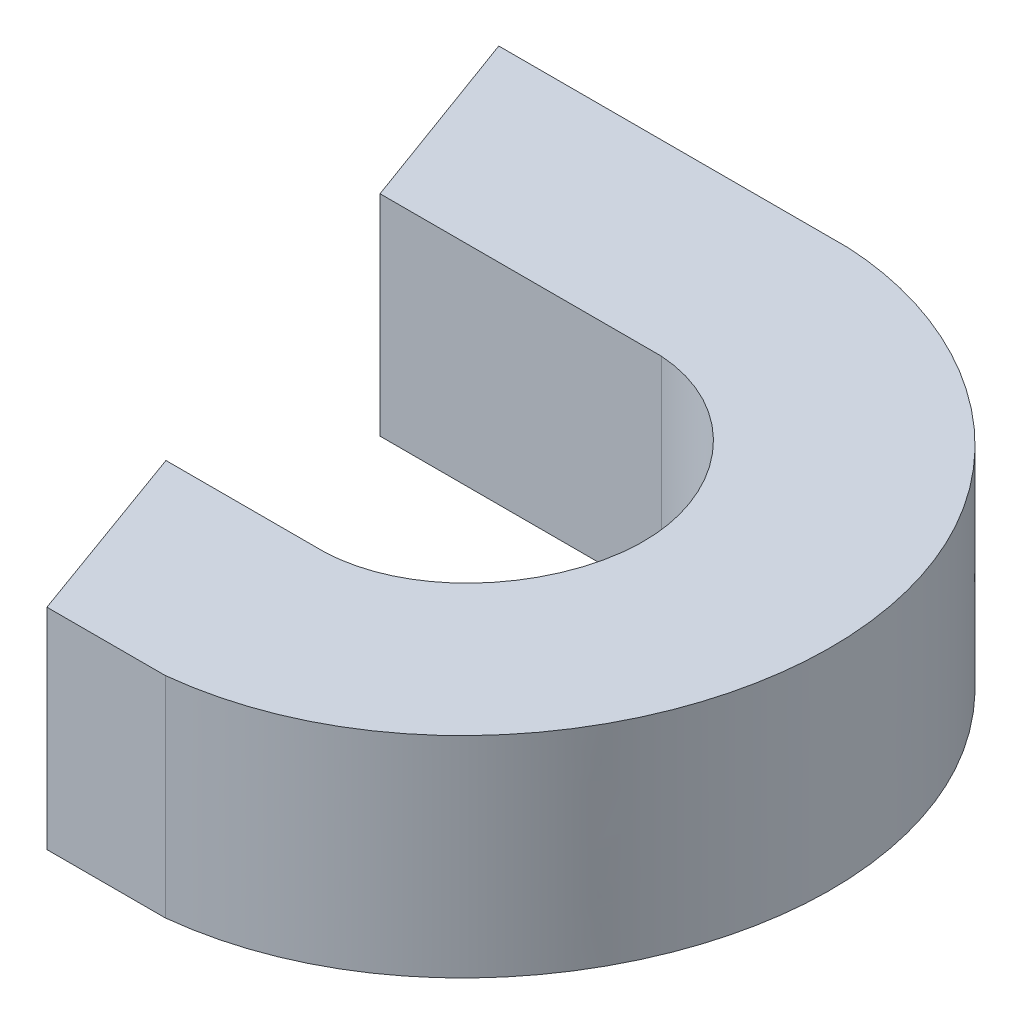
ISO-10303-21;
HEADER;
FILE_DESCRIPTION(('STEP AP214'),'2;1');
FILE_NAME('part.step','',(''),(''),'','','');
FILE_SCHEMA(('AUTOMOTIVE_DESIGN { 1 0 10303 214 1 1 1 1 }'));
ENDSEC;
DATA;
#1=APPLICATION_CONTEXT('core data for automotive mechanical design processes');
#2=APPLICATION_PROTOCOL_DEFINITION('international standard','automotive_design',2000,#1);
#3=PRODUCT_CONTEXT('',#1,'mechanical');
#4=PRODUCT('Part','Part','',(#3));
#5=PRODUCT_RELATED_PRODUCT_CATEGORY('part','',(#4));
#6=PRODUCT_DEFINITION_FORMATION('','',#4);
#7=PRODUCT_DEFINITION_CONTEXT('part definition',#1,'design');
#8=PRODUCT_DEFINITION('design','',#6,#7);
#9=PRODUCT_DEFINITION_SHAPE('','',#8);
#10=(LENGTH_UNIT() NAMED_UNIT(*) SI_UNIT(.MILLI.,.METRE.));
#11=(NAMED_UNIT(*) PLANE_ANGLE_UNIT() SI_UNIT($,.RADIAN.));
#12=(NAMED_UNIT(*) SI_UNIT($,.STERADIAN.) SOLID_ANGLE_UNIT());
#13=UNCERTAINTY_MEASURE_WITH_UNIT(LENGTH_MEASURE(1.E-05),#10,'distance_accuracy_value','');
#14=(GEOMETRIC_REPRESENTATION_CONTEXT(3) GLOBAL_UNCERTAINTY_ASSIGNED_CONTEXT((#13)) GLOBAL_UNIT_ASSIGNED_CONTEXT((#10,
#11,#12)) REPRESENTATION_CONTEXT('',''));
#15=CARTESIAN_POINT('',(0.,0.,0.));
#16=DIRECTION('',(0.,0.,1.));
#17=DIRECTION('',(1.,0.,0.));
#18=AXIS2_PLACEMENT_3D('',#15,#16,#17);
#19=CARTESIAN_POINT('',(162.372425992695,10.,-181.612223799451));
#20=DIRECTION('',(0.940293304521291,0.,-0.340365247157271));
#21=DIRECTION('',(-0.340365247157271,0.,-0.940293304521291));
#22=AXIS2_PLACEMENT_3D('',#19,#20,#21);
#23=PLANE('',#22);
#24=DIRECTION('',(0.340365247157271,0.,0.940293304521291));
#25=VECTOR('',#24,1.);
#26=CARTESIAN_POINT('',(162.372425992695,0.,-181.612223799451));
#27=LINE('',#26,#25);
#28=CARTESIAN_POINT('',(162.372425992695,0.,-181.612223799451));
#29=VERTEX_POINT('',#28);
#30=CARTESIAN_POINT('',(165.588889592896,0.,-172.726418880279));
#31=VERTEX_POINT('',#30);
#32=EDGE_CURVE('E189',#29,#31,#27,.T.);
#33=ORIENTED_EDGE('',*,*,#32,.T.);
#34=DIRECTION('',(0.,-1.,0.));
#35=VECTOR('',#34,1.);
#36=CARTESIAN_POINT('',(165.588889592896,10.,-172.726418880279));
#37=LINE('',#36,#35);
#38=CARTESIAN_POINT('',(165.588889592896,10.,-172.726418880279));
#39=VERTEX_POINT('',#38);
#40=EDGE_CURVE('E11',#39,#31,#37,.T.);
#41=ORIENTED_EDGE('',*,*,#40,.F.);
#42=DIRECTION('',(0.340365247157271,0.,0.940293304521291));
#43=VECTOR('',#42,1.);
#44=CARTESIAN_POINT('',(162.372425992695,10.,-181.612223799451));
#45=LINE('',#44,#43);
#46=CARTESIAN_POINT('',(162.372425992695,10.,-181.612223799451));
#47=VERTEX_POINT('',#46);
#48=EDGE_CURVE('E206',#47,#39,#45,.T.);
#49=ORIENTED_EDGE('',*,*,#48,.F.);
#50=DIRECTION('',(0.,-1.,0.));
#51=VECTOR('',#50,1.);
#52=CARTESIAN_POINT('',(162.372425992695,10.,-181.612223799451));
#53=LINE('',#52,#51);
#54=EDGE_CURVE('E122',#47,#29,#53,.T.);
#55=ORIENTED_EDGE('',*,*,#54,.T.);
#56=EDGE_LOOP('',(#33,#41,#49,#55));
#57=FACE_BOUND('',#56,.T.);
#58=ADVANCED_FACE('F30',(#57),#23,.F.);
#59=CARTESIAN_POINT('',(165.588889592896,10.,-172.726418880279));
#60=DIRECTION('',(0.,0.,-1.));
#61=DIRECTION('',(-1.,0.,0.));
#62=AXIS2_PLACEMENT_3D('',#59,#60,#61);
#63=PLANE('',#62);
#64=DIRECTION('',(1.,0.,0.));
#65=VECTOR('',#64,1.);
#66=CARTESIAN_POINT('',(165.588889592896,0.,-172.726418880279));
#67=LINE('',#66,#65);
#68=CARTESIAN_POINT('',(171.228007085612,0.,-172.726418880279));
#69=VERTEX_POINT('',#68);
#70=EDGE_CURVE('E186',#31,#69,#67,.T.);
#71=ORIENTED_EDGE('',*,*,#70,.T.);
#72=DIRECTION('',(0.,-1.,0.));
#73=VECTOR('',#72,1.);
#74=CARTESIAN_POINT('',(171.228007085612,10.,-172.726418880279));
#75=LINE('',#74,#73);
#76=CARTESIAN_POINT('',(171.228007085612,10.,-172.726418880279));
#77=VERTEX_POINT('',#76);
#78=EDGE_CURVE('E38',#77,#69,#75,.T.);
#79=ORIENTED_EDGE('',*,*,#78,.F.);
#80=DIRECTION('',(1.,0.,0.));
#81=VECTOR('',#80,1.);
#82=CARTESIAN_POINT('',(165.588889592896,10.,-172.726418880279));
#83=LINE('',#82,#81);
#84=EDGE_CURVE('E89',#39,#77,#83,.T.);
#85=ORIENTED_EDGE('',*,*,#84,.F.);
#86=ORIENTED_EDGE('',*,*,#40,.T.);
#87=EDGE_LOOP('',(#71,#79,#85,#86));
#88=FACE_BOUND('',#87,.T.);
#89=ADVANCED_FACE('F151',(#88),#63,.F.);
#90=CARTESIAN_POINT('',(171.228007085612,10.,-172.726418880279));
#91=CARTESIAN_POINT('',(180.377690760818,10.,-173.72553296733));
#92=CARTESIAN_POINT('',(187.93256805129,10.,-184.626735463749));
#93=CARTESIAN_POINT('',(183.685185867495,10.,-201.055507750901));
#94=CARTESIAN_POINT('',(175.689909714584,10.,-206.325221105294));
#95=CARTESIAN_POINT('',(169.867934904106,10.,-206.636519035794));
#96=B_SPLINE_CURVE_WITH_KNOTS('',3,(#90,#91,#92,#93,#94,#95),.UNSPECIFIED.,.F.,.F.,(4,1,1,4),
(0.,0.495187000090538,0.646189602277731,1.),.UNSPECIFIED.);
#97=DIRECTION('',(0.,-1.,0.));
#98=VECTOR('',#97,1.);
#99=SURFACE_OF_LINEAR_EXTRUSION('',#96,#98);
#100=CARTESIAN_POINT('',(171.228007085612,0.,-172.726418880279));
#101=CARTESIAN_POINT('',(180.377690760818,0.,-173.72553296733));
#102=CARTESIAN_POINT('',(187.93256805129,0.,-184.626735463749));
#103=CARTESIAN_POINT('',(183.685185867495,0.,-201.055507750901));
#104=CARTESIAN_POINT('',(175.689909714584,0.,-206.325221105294));
#105=CARTESIAN_POINT('',(169.867934904106,0.,-206.636519035794));
#106=B_SPLINE_CURVE_WITH_KNOTS('',3,(#100,#101,#102,#103,#104,#105),.UNSPECIFIED.,.F.,.F.,(4,1,
1,4),(0.,0.495187000090538,0.646189602277731,1.),.UNSPECIFIED.);
#107=CARTESIAN_POINT('',(169.867934904106,0.,-206.636519035794));
#108=VERTEX_POINT('',#107);
#109=EDGE_CURVE('E182',#69,#108,#106,.T.);
#110=ORIENTED_EDGE('',*,*,#109,.T.);
#111=DIRECTION('',(0.,-1.,0.));
#112=VECTOR('',#111,1.);
#113=CARTESIAN_POINT('',(169.867934904106,10.,-206.636519035794));
#114=LINE('',#113,#112);
#115=CARTESIAN_POINT('',(169.867934904106,10.,-206.636519035794));
#116=VERTEX_POINT('',#115);
#117=EDGE_CURVE('E174',#116,#108,#114,.T.);
#118=ORIENTED_EDGE('',*,*,#117,.F.);
#119=EDGE_CURVE('E153',#77,#116,#96,.T.);
#120=ORIENTED_EDGE('',*,*,#119,.F.);
#121=ORIENTED_EDGE('',*,*,#78,.T.);
#122=EDGE_LOOP('',(#110,#118,#120,#121));
#123=FACE_BOUND('',#122,.T.);
#124=ADVANCED_FACE('F147',(#123),#99,.F.);
#125=CARTESIAN_POINT('',(153.200861874231,10.,-206.636519035794));
#126=DIRECTION('',(0.,0.,1.));
#127=DIRECTION('',(1.,0.,0.));
#128=AXIS2_PLACEMENT_3D('',#125,#126,#127);
#129=PLANE('',#128);
#130=DIRECTION('',(-1.,0.,0.));
#131=VECTOR('',#130,1.);
#132=CARTESIAN_POINT('',(153.200861874231,0.,-206.636519035794));
#133=LINE('',#132,#131);
#134=CARTESIAN_POINT('',(153.200861874231,0.,-206.636519035794));
#135=VERTEX_POINT('',#134);
#136=EDGE_CURVE('E172',#108,#135,#133,.T.);
#137=ORIENTED_EDGE('',*,*,#136,.T.);
#138=DIRECTION('',(0.,-1.,0.));
#139=VECTOR('',#138,1.);
#140=CARTESIAN_POINT('',(153.200861874231,10.,-206.636519035794));
#141=LINE('',#140,#139);
#142=CARTESIAN_POINT('',(153.200861874231,10.,-206.636519035794));
#143=VERTEX_POINT('',#142);
#144=EDGE_CURVE('E170',#143,#135,#141,.T.);
#145=ORIENTED_EDGE('',*,*,#144,.F.);
#146=DIRECTION('',(-1.,0.,0.));
#147=VECTOR('',#146,1.);
#148=CARTESIAN_POINT('',(153.200861874231,10.,-206.636519035794));
#149=LINE('',#148,#147);
#150=EDGE_CURVE('E159',#116,#143,#149,.T.);
#151=ORIENTED_EDGE('',*,*,#150,.F.);
#152=ORIENTED_EDGE('',*,*,#117,.T.);
#153=EDGE_LOOP('',(#137,#145,#151,#152));
#154=FACE_BOUND('',#153,.T.);
#155=ADVANCED_FACE('F143',(#154),#129,.F.);
#156=CARTESIAN_POINT('',(156.467404622132,10.,-197.714993681311));
#157=DIRECTION('',(0.939035537154817,0.,-0.343820098249599));
#158=DIRECTION('',(-0.343820098249599,0.,-0.939035537154818));
#159=AXIS2_PLACEMENT_3D('',#156,#157,#158);
#160=PLANE('',#159);
#161=DIRECTION('',(0.343820098249599,0.,0.939035537154817));
#162=VECTOR('',#161,1.);
#163=CARTESIAN_POINT('',(156.467404622132,0.,-197.714993681311));
#164=LINE('',#163,#162);
#165=CARTESIAN_POINT('',(156.467404622132,0.,-197.714993681311));
#166=VERTEX_POINT('',#165);
#167=EDGE_CURVE('E176',#135,#166,#164,.T.);
#168=ORIENTED_EDGE('',*,*,#167,.T.);
#169=DIRECTION('',(0.,-1.,0.));
#170=VECTOR('',#169,1.);
#171=CARTESIAN_POINT('',(156.467404622132,10.,-197.714993681311));
#172=LINE('',#171,#170);
#173=CARTESIAN_POINT('',(156.467404622132,10.,-197.714993681311));
#174=VERTEX_POINT('',#173);
#175=EDGE_CURVE('E117',#174,#166,#172,.T.);
#176=ORIENTED_EDGE('',*,*,#175,.F.);
#177=DIRECTION('',(0.343820098249599,0.,0.939035537154817));
#178=VECTOR('',#177,1.);
#179=CARTESIAN_POINT('',(156.467404622132,10.,-197.714993681311));
#180=LINE('',#179,#178);
#181=EDGE_CURVE('E108',#143,#174,#180,.T.);
#182=ORIENTED_EDGE('',*,*,#181,.F.);
#183=ORIENTED_EDGE('',*,*,#144,.T.);
#184=EDGE_LOOP('',(#168,#176,#182,#183));
#185=FACE_BOUND('',#184,.T.);
#186=ADVANCED_FACE('F140',(#185),#160,.F.);
#187=CARTESIAN_POINT('',(169.867934904106,10.,-197.714993681311));
#188=DIRECTION('',(0.,0.,-1.));
#189=DIRECTION('',(-1.,0.,0.));
#190=AXIS2_PLACEMENT_3D('',#187,#188,#189);
#191=PLANE('',#190);
#192=DIRECTION('',(1.,0.,0.));
#193=VECTOR('',#192,1.);
#194=CARTESIAN_POINT('',(169.867934904106,0.,-197.714993681311));
#195=LINE('',#194,#193);
#196=CARTESIAN_POINT('',(169.867934904106,0.,-197.714993681311));
#197=VERTEX_POINT('',#196);
#198=EDGE_CURVE('E116',#166,#197,#195,.T.);
#199=ORIENTED_EDGE('',*,*,#198,.T.);
#200=DIRECTION('',(0.,-1.,0.));
#201=VECTOR('',#200,1.);
#202=CARTESIAN_POINT('',(169.867934904106,10.,-197.714993681311));
#203=LINE('',#202,#201);
#204=CARTESIAN_POINT('',(169.867934904106,10.,-197.714993681311));
#205=VERTEX_POINT('',#204);
#206=EDGE_CURVE('E113',#205,#197,#203,.T.);
#207=ORIENTED_EDGE('',*,*,#206,.F.);
#208=DIRECTION('',(1.,0.,0.));
#209=VECTOR('',#208,1.);
#210=CARTESIAN_POINT('',(169.867934904106,10.,-197.714993681311));
#211=LINE('',#210,#209);
#212=EDGE_CURVE('E102',#174,#205,#211,.T.);
#213=ORIENTED_EDGE('',*,*,#212,.F.);
#214=ORIENTED_EDGE('',*,*,#175,.T.);
#215=EDGE_LOOP('',(#199,#207,#213,#214));
#216=FACE_BOUND('',#215,.T.);
#217=ADVANCED_FACE('F114',(#216),#191,.F.);
#218=CARTESIAN_POINT('',(169.867934904106,10.,-197.714993681311));
#219=CARTESIAN_POINT('',(173.645019010626,10.,-197.470156892362));
#220=CARTESIAN_POINT('',(180.208072332535,10.,-190.117020798429));
#221=CARTESIAN_POINT('',(174.275480801201,10.,-181.738846550226));
#222=CARTESIAN_POINT('',(169.867934904106,10.,-181.612223799451));
#223=B_SPLINE_CURVE_WITH_KNOTS('',3,(#218,#219,#220,#221,#222),.UNSPECIFIED.,.F.,.F.,(4,1,4),
(0.,0.474216118489256,1.),.UNSPECIFIED.);
#224=DIRECTION('',(0.,-1.,0.));
#225=VECTOR('',#224,1.);
#226=SURFACE_OF_LINEAR_EXTRUSION('',#223,#225);
#227=CARTESIAN_POINT('',(169.867934904106,0.,-197.714993681311));
#228=CARTESIAN_POINT('',(173.645019010626,0.,-197.470156892362));
#229=CARTESIAN_POINT('',(180.208072332535,0.,-190.117020798429));
#230=CARTESIAN_POINT('',(174.275480801201,0.,-181.738846550226));
#231=CARTESIAN_POINT('',(169.867934904106,0.,-181.612223799451));
#232=B_SPLINE_CURVE_WITH_KNOTS('',3,(#227,#228,#229,#230,#231),.UNSPECIFIED.,.F.,.F.,(4,1,4),
(0.,0.474216118489256,1.),.UNSPECIFIED.);
#233=CARTESIAN_POINT('',(169.867934904106,0.,-181.612223799451));
#234=VERTEX_POINT('',#233);
#235=EDGE_CURVE('E75',#197,#234,#232,.T.);
#236=ORIENTED_EDGE('',*,*,#235,.T.);
#237=DIRECTION('',(0.,-1.,0.));
#238=VECTOR('',#237,1.);
#239=CARTESIAN_POINT('',(169.867934904106,10.,-181.612223799451));
#240=LINE('',#239,#238);
#241=CARTESIAN_POINT('',(169.867934904106,10.,-181.612223799451));
#242=VERTEX_POINT('',#241);
#243=EDGE_CURVE('E118',#242,#234,#240,.T.);
#244=ORIENTED_EDGE('',*,*,#243,.F.);
#245=EDGE_CURVE('E106',#205,#242,#223,.T.);
#246=ORIENTED_EDGE('',*,*,#245,.F.);
#247=ORIENTED_EDGE('',*,*,#206,.T.);
#248=EDGE_LOOP('',(#236,#244,#246,#247));
#249=FACE_BOUND('',#248,.T.);
#250=ADVANCED_FACE('F120',(#249),#226,.F.);
#251=CARTESIAN_POINT('',(162.372425992695,10.,-181.612223799451));
#252=DIRECTION('',(0.,0.,1.));
#253=DIRECTION('',(1.,0.,0.));
#254=AXIS2_PLACEMENT_3D('',#251,#252,#253);
#255=PLANE('',#254);
#256=DIRECTION('',(-1.,0.,0.));
#257=VECTOR('',#256,1.);
#258=CARTESIAN_POINT('',(162.372425992695,0.,-181.612223799451));
#259=LINE('',#258,#257);
#260=EDGE_CURVE('E81',#234,#29,#259,.T.);
#261=ORIENTED_EDGE('',*,*,#260,.T.);
#262=ORIENTED_EDGE('',*,*,#54,.F.);
#263=DIRECTION('',(-1.,0.,0.));
#264=VECTOR('',#263,1.);
#265=CARTESIAN_POINT('',(162.372425992695,10.,-181.612223799451));
#266=LINE('',#265,#264);
#267=EDGE_CURVE('E46',#242,#47,#266,.T.);
#268=ORIENTED_EDGE('',*,*,#267,.F.);
#269=ORIENTED_EDGE('',*,*,#243,.T.);
#270=EDGE_LOOP('',(#261,#262,#268,#269));
#271=FACE_BOUND('',#270,.T.);
#272=ADVANCED_FACE('F136',(#271),#255,.F.);
#273=CARTESIAN_POINT('',(185.898998982028,10.,-190.504342054814));
#274=DIRECTION('',(0.,1.,0.));
#275=DIRECTION('',(0.,0.,1.));
#276=AXIS2_PLACEMENT_3D('',#273,#274,#275);
#277=PLANE('',#276);
#278=ORIENTED_EDGE('',*,*,#48,.T.);
#279=ORIENTED_EDGE('',*,*,#84,.T.);
#280=ORIENTED_EDGE('',*,*,#119,.T.);
#281=ORIENTED_EDGE('',*,*,#150,.T.);
#282=ORIENTED_EDGE('',*,*,#181,.T.);
#283=ORIENTED_EDGE('',*,*,#212,.T.);
#284=ORIENTED_EDGE('',*,*,#245,.T.);
#285=ORIENTED_EDGE('',*,*,#267,.T.);
#286=EDGE_LOOP('',(#278,#279,#280,#281,#282,#283,#284,#285));
#287=FACE_BOUND('',#286,.T.);
#288=ADVANCED_FACE('F104',(#287),#277,.T.);
#289=CARTESIAN_POINT('',(185.898998982028,0.,-190.504342054814));
#290=DIRECTION('',(0.,1.,0.));
#291=DIRECTION('',(0.,0.,1.));
#292=AXIS2_PLACEMENT_3D('',#289,#290,#291);
#293=PLANE('',#292);
#294=ORIENTED_EDGE('',*,*,#32,.F.);
#295=ORIENTED_EDGE('',*,*,#260,.F.);
#296=ORIENTED_EDGE('',*,*,#235,.F.);
#297=ORIENTED_EDGE('',*,*,#198,.F.);
#298=ORIENTED_EDGE('',*,*,#167,.F.);
#299=ORIENTED_EDGE('',*,*,#136,.F.);
#300=ORIENTED_EDGE('',*,*,#109,.F.);
#301=ORIENTED_EDGE('',*,*,#70,.F.);
#302=EDGE_LOOP('',(#294,#295,#296,#297,#298,#299,#300,#301));
#303=FACE_BOUND('',#302,.T.);
#304=ADVANCED_FACE('F185',(#303),#293,.F.);
#305=CLOSED_SHELL('',(#58,#89,#124,#155,#186,#217,#250,#272,#288,#304));
#306=MANIFOLD_SOLID_BREP('B2',#305);
#307=ADVANCED_BREP_SHAPE_REPRESENTATION('',(#18,#306),#14);
#308=SHAPE_DEFINITION_REPRESENTATION(#9,#307);
ENDSEC;
END-ISO-10303-21;
